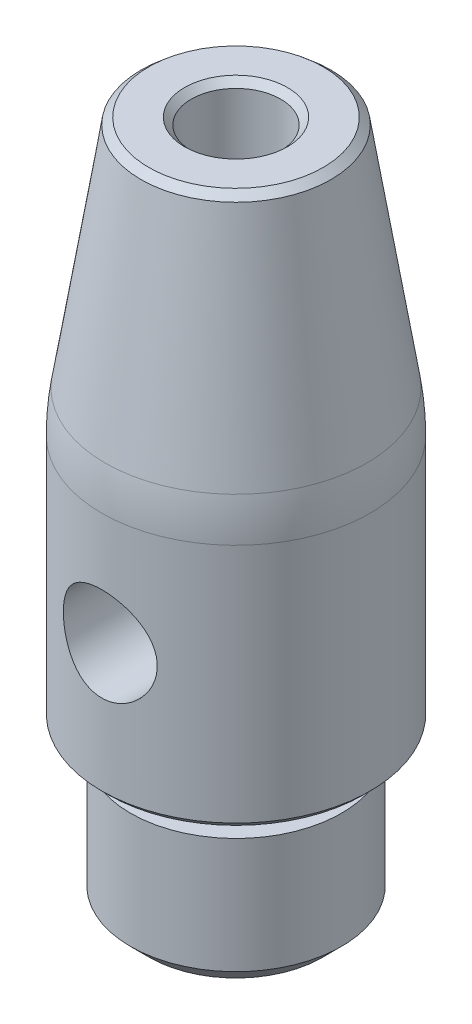
ISO-10303-21;
HEADER;
FILE_DESCRIPTION(('STEP AP214'),'2;1');
FILE_NAME('part.step','',(''),(''),'','','');
FILE_SCHEMA(('AUTOMOTIVE_DESIGN { 1 0 10303 214 1 1 1 1 }'));
ENDSEC;
DATA;
#1=APPLICATION_CONTEXT('core data for automotive mechanical design processes');
#2=APPLICATION_PROTOCOL_DEFINITION('international standard','automotive_design',2000,#1);
#3=PRODUCT_CONTEXT('',#1,'mechanical');
#4=PRODUCT('Part','Part','',(#3));
#5=PRODUCT_RELATED_PRODUCT_CATEGORY('part','',(#4));
#6=PRODUCT_DEFINITION_FORMATION('','',#4);
#7=PRODUCT_DEFINITION_CONTEXT('part definition',#1,'design');
#8=PRODUCT_DEFINITION('design','',#6,#7);
#9=PRODUCT_DEFINITION_SHAPE('','',#8);
#10=(LENGTH_UNIT() NAMED_UNIT(*) SI_UNIT(.MILLI.,.METRE.));
#11=(NAMED_UNIT(*) PLANE_ANGLE_UNIT() SI_UNIT($,.RADIAN.));
#12=(NAMED_UNIT(*) SI_UNIT($,.STERADIAN.) SOLID_ANGLE_UNIT());
#13=UNCERTAINTY_MEASURE_WITH_UNIT(LENGTH_MEASURE(1.E-05),#10,'distance_accuracy_value','');
#14=(GEOMETRIC_REPRESENTATION_CONTEXT(3) GLOBAL_UNCERTAINTY_ASSIGNED_CONTEXT((#13)) GLOBAL_UNIT_ASSIGNED_CONTEXT((#10,
#11,#12)) REPRESENTATION_CONTEXT('',''));
#15=CARTESIAN_POINT('',(0.,0.,0.));
#16=DIRECTION('',(0.,0.,1.));
#17=DIRECTION('',(1.,0.,0.));
#18=AXIS2_PLACEMENT_3D('',#15,#16,#17);
#19=CARTESIAN_POINT('',(0.,0.,0.));
#20=DIRECTION('',(0.,-1.,0.));
#21=DIRECTION('',(0.,0.,-1.));
#22=AXIS2_PLACEMENT_3D('',#19,#20,#21);
#23=PLANE('',#22);
#24=CARTESIAN_POINT('',(0.,0.,0.));
#25=DIRECTION('',(0.,1.,0.));
#26=DIRECTION('',(0.,0.,1.));
#27=AXIS2_PLACEMENT_3D('',#24,#25,#26);
#28=CIRCLE('',#27,3.23299999990923);
#29=CARTESIAN_POINT('',(0.,0.,3.23299999990923));
#30=VERTEX_POINT('',#29);
#31=EDGE_CURVE('E20',#30,#30,#28,.T.);
#32=ORIENTED_EDGE('',*,*,#31,.F.);
#33=EDGE_LOOP('',(#32));
#34=FACE_BOUND('',#33,.T.);
#35=ADVANCED_FACE('F16',(#34),#23,.T.);
#36=CARTESIAN_POINT('',(0.,15.4999999999745,0.));
#37=DIRECTION('',(0.,1.,0.));
#38=DIRECTION('',(0.,0.,1.));
#39=AXIS2_PLACEMENT_3D('',#36,#37,#38);
#40=CONICAL_SURFACE('',#39,1.66600000000017,1.0297442586289);
#41=CARTESIAN_POINT('',(0.,15.5,0.));
#42=DIRECTION('',(0.,-1.,0.));
#43=DIRECTION('',(0.,0.,-1.));
#44=AXIS2_PLACEMENT_3D('',#41,#42,#43);
#45=CIRCLE('',#44,1.666);
#46=CARTESIAN_POINT('',(0.,15.5,-1.666));
#47=VERTEX_POINT('',#46);
#48=EDGE_CURVE('E94',#47,#47,#45,.F.);
#49=ORIENTED_EDGE('',*,*,#48,.T.);
#50=EDGE_LOOP('',(#49));
#51=FACE_BOUND('',#50,.T.);
#52=CARTESIAN_POINT('',(0.,14.4989662086346,1.13686837721616E-10));
#53=VERTEX_POINT('',#52);
#54=VERTEX_LOOP('',#53);
#55=FACE_BOUND('',#54,.T.);
#56=ADVANCED_FACE('F28',(#51,#55),#40,.F.);
#57=CARTESIAN_POINT('',(0.,0.699999999994816,0.));
#58=DIRECTION('',(0.,1.,0.));
#59=DIRECTION('',(0.,0.,1.));
#60=AXIS2_PLACEMENT_3D('',#57,#58,#59);
#61=CONICAL_SURFACE('',#60,3.9329999998472,0.785398163356846);
#62=CARTESIAN_POINT('',(0.,0.7,0.));
#63=DIRECTION('',(0.,-1.,0.));
#64=DIRECTION('',(0.,0.,-1.));
#65=AXIS2_PLACEMENT_3D('',#62,#63,#64);
#66=CIRCLE('',#65,3.933);
#67=CARTESIAN_POINT('',(0.,0.7,-3.933));
#68=VERTEX_POINT('',#67);
#69=EDGE_CURVE('E90',#68,#68,#66,.F.);
#70=ORIENTED_EDGE('',*,*,#69,.F.);
#71=EDGE_LOOP('',(#70));
#72=FACE_BOUND('',#71,.T.);
#73=ORIENTED_EDGE('',*,*,#31,.T.);
#74=EDGE_LOOP('',(#73));
#75=FACE_BOUND('',#74,.T.);
#76=ADVANCED_FACE('F30',(#72,#75),#61,.T.);
#77=CARTESIAN_POINT('',(0.,20.5,0.));
#78=DIRECTION('',(0.,-1.,0.));
#79=DIRECTION('',(0.,0.,-1.));
#80=AXIS2_PLACEMENT_3D('',#77,#78,#79);
#81=CYLINDRICAL_SURFACE('',#80,1.666);
#82=ORIENTED_EDGE('',*,*,#48,.F.);
#83=EDGE_LOOP('',(#82));
#84=FACE_BOUND('',#83,.T.);
#85=CARTESIAN_POINT('',(0.,25.2500000000282,0.));
#86=DIRECTION('',(0.,1.,0.));
#87=DIRECTION('',(0.,0.,-1.));
#88=AXIS2_PLACEMENT_3D('',#85,#86,#87);
#89=CIRCLE('',#88,1.66600000000017);
#90=CARTESIAN_POINT('',(0.,25.2500000000282,-1.66600000000017));
#91=VERTEX_POINT('',#90);
#92=EDGE_CURVE('E86',#91,#91,#89,.T.);
#93=ORIENTED_EDGE('',*,*,#92,.T.);
#94=EDGE_LOOP('',(#93));
#95=FACE_BOUND('',#94,.T.);
#96=ADVANCED_FACE('F38',(#84,#95),#81,.F.);
#97=CARTESIAN_POINT('',(0.,2.5,0.));
#98=DIRECTION('',(0.,-1.,0.));
#99=DIRECTION('',(0.,0.,-1.));
#100=AXIS2_PLACEMENT_3D('',#97,#98,#99);
#101=CYLINDRICAL_SURFACE('',#100,3.933);
#102=CARTESIAN_POINT('',(0.,5.,0.));
#103=DIRECTION('',(0.,-1.,0.));
#104=DIRECTION('',(0.,0.,-1.));
#105=AXIS2_PLACEMENT_3D('',#102,#103,#104);
#106=CIRCLE('',#105,3.933);
#107=CARTESIAN_POINT('',(0.,5.,-3.933));
#108=VERTEX_POINT('',#107);
#109=EDGE_CURVE('E84',#108,#108,#106,.F.);
#110=ORIENTED_EDGE('',*,*,#109,.F.);
#111=EDGE_LOOP('',(#110));
#112=FACE_BOUND('',#111,.T.);
#113=ORIENTED_EDGE('',*,*,#69,.T.);
#114=EDGE_LOOP('',(#113));
#115=FACE_BOUND('',#114,.T.);
#116=ADVANCED_FACE('F152',(#112,#115),#101,.T.);
#117=CARTESIAN_POINT('',(0.,25.5000000000791,0.));
#118=DIRECTION('',(0.,1.,0.));
#119=DIRECTION('',(0.,0.,1.));
#120=AXIS2_PLACEMENT_3D('',#117,#118,#119);
#121=CONICAL_SURFACE('',#120,1.91599999999426,0.785398163283761);
#122=ORIENTED_EDGE('',*,*,#92,.F.);
#123=EDGE_LOOP('',(#122));
#124=FACE_BOUND('',#123,.T.);
#125=CARTESIAN_POINT('',(0.,25.5000000000791,0.));
#126=DIRECTION('',(0.,1.,0.));
#127=DIRECTION('',(0.,0.,1.));
#128=AXIS2_PLACEMENT_3D('',#125,#126,#127);
#129=CIRCLE('',#128,1.91599999999426);
#130=CARTESIAN_POINT('',(0.,25.5000000000791,1.91599999999426));
#131=VERTEX_POINT('',#130);
#132=EDGE_CURVE('E82',#131,#131,#129,.F.);
#133=ORIENTED_EDGE('',*,*,#132,.F.);
#134=EDGE_LOOP('',(#133));
#135=FACE_BOUND('',#134,.T.);
#136=ADVANCED_FACE('F148',(#124,#135),#121,.F.);
#137=CARTESIAN_POINT('',(4.,5.,0.));
#138=DIRECTION('',(0.,1.,0.));
#139=DIRECTION('',(0.,0.,1.));
#140=AXIS2_PLACEMENT_3D('',#137,#138,#139);
#141=PLANE('',#140);
#142=CARTESIAN_POINT('',(0.,5.,0.));
#143=DIRECTION('',(0.,-1.,0.));
#144=DIRECTION('',(0.,0.,-1.));
#145=AXIS2_PLACEMENT_3D('',#142,#143,#144);
#146=CIRCLE('',#145,3.25);
#147=CARTESIAN_POINT('',(0.,5.,-3.25));
#148=VERTEX_POINT('',#147);
#149=EDGE_CURVE('E79',#148,#148,#146,.F.);
#150=ORIENTED_EDGE('',*,*,#149,.F.);
#151=EDGE_LOOP('',(#150));
#152=FACE_BOUND('',#151,.T.);
#153=ORIENTED_EDGE('',*,*,#109,.T.);
#154=EDGE_LOOP('',(#153));
#155=FACE_BOUND('',#154,.T.);
#156=ADVANCED_FACE('F144',(#152,#155),#141,.T.);
#157=CARTESIAN_POINT('',(3.5,25.5,0.));
#158=DIRECTION('',(0.,1.,0.));
#159=DIRECTION('',(0.,0.,1.));
#160=AXIS2_PLACEMENT_3D('',#157,#158,#159);
#161=PLANE('',#160);
#162=ORIENTED_EDGE('',*,*,#132,.T.);
#163=EDGE_LOOP('',(#162));
#164=FACE_BOUND('',#163,.T.);
#165=CARTESIAN_POINT('',(0.,25.4999999999654,0.));
#166=DIRECTION('',(0.,-1.,0.));
#167=DIRECTION('',(0.,0.,-1.));
#168=AXIS2_PLACEMENT_3D('',#165,#166,#167);
#169=CIRCLE('',#168,3.25000000003683);
#170=CARTESIAN_POINT('',(0.,25.4999999999654,-3.25000000003683));
#171=VERTEX_POINT('',#170);
#172=EDGE_CURVE('E76',#171,#171,#169,.T.);
#173=ORIENTED_EDGE('',*,*,#172,.F.);
#174=EDGE_LOOP('',(#173));
#175=FACE_BOUND('',#174,.T.);
#176=ADVANCED_FACE('F140',(#164,#175),#161,.T.);
#177=CARTESIAN_POINT('',(0.,5.5,0.));
#178=DIRECTION('',(0.,-1.,0.));
#179=DIRECTION('',(0.,0.,-1.));
#180=AXIS2_PLACEMENT_3D('',#177,#178,#179);
#181=CYLINDRICAL_SURFACE('',#180,3.25);
#182=CARTESIAN_POINT('',(0.,6.,0.));
#183=DIRECTION('',(0.,-1.,0.));
#184=DIRECTION('',(0.,0.,-1.));
#185=AXIS2_PLACEMENT_3D('',#182,#183,#184);
#186=CIRCLE('',#185,3.25);
#187=CARTESIAN_POINT('',(0.,6.,-3.25));
#188=VERTEX_POINT('',#187);
#189=EDGE_CURVE('E73',#188,#188,#186,.F.);
#190=ORIENTED_EDGE('',*,*,#189,.F.);
#191=EDGE_LOOP('',(#190));
#192=FACE_BOUND('',#191,.T.);
#193=ORIENTED_EDGE('',*,*,#149,.T.);
#194=EDGE_LOOP('',(#193));
#195=FACE_BOUND('',#194,.T.);
#196=ADVANCED_FACE('F136',(#192,#195),#181,.T.);
#197=CARTESIAN_POINT('',(0.,25.2530592586595,0.));
#198=DIRECTION('',(0.,-1.,0.));
#199=DIRECTION('',(0.,0.,-1.));
#200=AXIS2_PLACEMENT_3D('',#197,#198,#199);
#201=CONICAL_SURFACE('',#200,3.53899064339203,0.8636991019188);
#202=ORIENTED_EDGE('',*,*,#172,.T.);
#203=EDGE_LOOP('',(#202));
#204=FACE_BOUND('',#203,.T.);
#205=CARTESIAN_POINT('',(0.,25.2530592586595,0.));
#206=DIRECTION('',(0.,-1.,0.));
#207=DIRECTION('',(1.,0.,0.));
#208=AXIS2_PLACEMENT_3D('',#205,#206,#207);
#209=CIRCLE('',#208,3.5389906433636);
#210=CARTESIAN_POINT('',(3.5389906433636,25.2530592586595,0.));
#211=VERTEX_POINT('',#210);
#212=EDGE_CURVE('E72',#211,#211,#209,.T.);
#213=ORIENTED_EDGE('',*,*,#212,.F.);
#214=EDGE_LOOP('',(#213));
#215=FACE_BOUND('',#214,.T.);
#216=ADVANCED_FACE('F130',(#204,#215),#201,.T.);
#217=CARTESIAN_POINT('',(3.25,6.,0.));
#218=DIRECTION('',(0.,-1.,0.));
#219=DIRECTION('',(0.,0.,-1.));
#220=AXIS2_PLACEMENT_3D('',#217,#218,#219);
#221=PLANE('',#220);
#222=ORIENTED_EDGE('',*,*,#189,.T.);
#223=EDGE_LOOP('',(#222));
#224=FACE_BOUND('',#223,.T.);
#225=CARTESIAN_POINT('',(0.,5.99999999991496,0.));
#226=DIRECTION('',(0.,1.,0.));
#227=DIRECTION('',(0.,0.,1.));
#228=AXIS2_PLACEMENT_3D('',#225,#226,#227);
#229=CIRCLE('',#228,4.75000000000136);
#230=CARTESIAN_POINT('',(0.,5.99999999991496,4.75000000000136));
#231=VERTEX_POINT('',#230);
#232=EDGE_CURVE('E68',#231,#231,#229,.T.);
#233=ORIENTED_EDGE('',*,*,#232,.F.);
#234=EDGE_LOOP('',(#233));
#235=FACE_BOUND('',#234,.T.);
#236=ADVANCED_FACE('F124',(#224,#235),#221,.T.);
#237=CARTESIAN_POINT('',(0.,16.7750121959784,0.));
#238=DIRECTION('',(0.,-1.,0.));
#239=DIRECTION('',(0.,0.,-1.));
#240=AXIS2_PLACEMENT_3D('',#237,#238,#239);
#241=CONICAL_SURFACE('',#240,4.8776296532651,0.156601876982704);
#242=ORIENTED_EDGE('',*,*,#212,.T.);
#243=EDGE_LOOP('',(#242));
#244=FACE_BOUND('',#243,.T.);
#245=CARTESIAN_POINT('',(0.,16.7750121958256,0.));
#246=DIRECTION('',(0.,1.,0.));
#247=DIRECTION('',(0.,0.,1.));
#248=AXIS2_PLACEMENT_3D('',#245,#246,#247);
#249=CIRCLE('',#248,4.87762965329069);
#250=CARTESIAN_POINT('',(0.,16.7750121958256,4.87762965329069));
#251=VERTEX_POINT('',#250);
#252=EDGE_CURVE('E71',#251,#251,#249,.T.);
#253=ORIENTED_EDGE('',*,*,#252,.T.);
#254=EDGE_LOOP('',(#253));
#255=FACE_BOUND('',#254,.T.);
#256=ADVANCED_FACE('F119',(#244,#255),#241,.T.);
#257=CARTESIAN_POINT('',(0.,6.24999999990905,0.));
#258=DIRECTION('',(0.,1.,0.));
#259=DIRECTION('',(0.,0.,1.));
#260=AXIS2_PLACEMENT_3D('',#257,#258,#259);
#261=CONICAL_SURFACE('',#260,4.99999999999545,0.785398163397448);
#262=CARTESIAN_POINT('',(0.,6.25,0.));
#263=DIRECTION('',(0.,-1.,0.));
#264=DIRECTION('',(0.,0.,-1.));
#265=AXIS2_PLACEMENT_3D('',#262,#263,#264);
#266=CIRCLE('',#265,5.);
#267=CARTESIAN_POINT('',(0.,6.25,-5.));
#268=VERTEX_POINT('',#267);
#269=EDGE_CURVE('E106',#268,#268,#266,.F.);
#270=ORIENTED_EDGE('',*,*,#269,.F.);
#271=EDGE_LOOP('',(#270));
#272=FACE_BOUND('',#271,.T.);
#273=ORIENTED_EDGE('',*,*,#232,.T.);
#274=EDGE_LOOP('',(#273));
#275=FACE_BOUND('',#274,.T.);
#276=ADVANCED_FACE('F114',(#272,#275),#261,.T.);
#277=CARTESIAN_POINT('',(0.,15.2153864610955,0.));
#278=DIRECTION('',(0.,-1.,0.));
#279=DIRECTION('',(0.,0.,-1.));
#280=AXIS2_PLACEMENT_3D('',#277,#278,#279);
#281=DEGENERATE_TOROIDAL_SURFACE('',#280,4.99999999999954,9.99999999999954,.F.);
#282=ORIENTED_EDGE('',*,*,#252,.F.);
#283=EDGE_LOOP('',(#282));
#284=FACE_BOUND('',#283,.T.);
#285=CARTESIAN_POINT('',(0.,15.2153864610955,0.));
#286=DIRECTION('',(0.,-1.,0.));
#287=DIRECTION('',(0.,0.,-1.));
#288=AXIS2_PLACEMENT_3D('',#285,#286,#287);
#289=CIRCLE('',#288,5.);
#290=CARTESIAN_POINT('',(0.,15.2153864610955,-5.));
#291=VERTEX_POINT('',#290);
#292=EDGE_CURVE('E67',#291,#291,#289,.T.);
#293=ORIENTED_EDGE('',*,*,#292,.F.);
#294=EDGE_LOOP('',(#293));
#295=FACE_BOUND('',#294,.T.);
#296=ADVANCED_FACE('F18',(#284,#295),#281,.F.);
#297=CARTESIAN_POINT('',(0.,11.,0.));
#298=DIRECTION('',(0.,0.,1.));
#299=DIRECTION('',(1.,0.,0.));
#300=AXIS2_PLACEMENT_3D('',#297,#298,#299);
#301=CYLINDRICAL_SURFACE('',#300,1.75);
#302=CARTESIAN_POINT('',(-1.75,11.,4.6837484987988));
#303=CARTESIAN_POINT('',(-1.75000152826706,11.0950076142216,4.68374720485959));
#304=CARTESIAN_POINT('',(-1.74223702845892,11.1900045831409,4.68667080692753));
#305=CARTESIAN_POINT('',(-1.71150284343091,11.377164613439,4.6979805396323));
#306=CARTESIAN_POINT('',(-1.68853189484273,11.4693274386883,4.70636712413873));
#307=CARTESIAN_POINT('',(-1.6283062855171,11.6480733418047,4.72753898808221));
#308=CARTESIAN_POINT('',(-1.59108197521608,11.7346678221525,4.74031491516133));
#309=CARTESIAN_POINT('',(-1.50351160924169,11.9004133837024,4.76881178214549));
#310=CARTESIAN_POINT('',(-1.45316221737773,11.9795625654549,4.78453347053087));
#311=CARTESIAN_POINT('',(-1.33844146982531,12.1315893083913,4.81791171246093));
#312=CARTESIAN_POINT('',(-1.27359743759366,12.2040989219186,4.83561998092638));
#313=CARTESIAN_POINT('',(-1.13273458125577,12.3374687470166,4.87054126917138));
#314=CARTESIAN_POINT('',(-1.05671375209411,12.3983268638541,4.88775419942611));
#315=CARTESIAN_POINT('',(-0.892925093026129,12.50837506446,4.92035027857299));
#316=CARTESIAN_POINT('',(-0.804879787036825,12.5571740450381,4.93566559950246));
#317=CARTESIAN_POINT('',(-0.621200717106752,12.6391198088743,4.96212680122129));
#318=CARTESIAN_POINT('',(-0.52556923264072,12.6722712732039,4.9732739287493));
#319=CARTESIAN_POINT('',(-0.333294441128115,12.7207167887382,4.98977617197834));
#320=CARTESIAN_POINT('',(-0.236828119050407,12.736642372526,4.99533555255298));
#321=CARTESIAN_POINT('',(-0.0424428010719142,12.7521980876596,5.00076407475328));
#322=CARTESIAN_POINT('',(0.055475774937992,12.7518328407775,5.00063483026419));
#323=CARTESIAN_POINT('',(0.245494270684965,12.7352051918272,4.99483582345016));
#324=CARTESIAN_POINT('',(0.337662857195478,12.7196299848309,4.98940556776971));
#325=CARTESIAN_POINT('',(0.517984230962889,12.6741684860387,4.97392058678691));
#326=CARTESIAN_POINT('',(0.606136739449903,12.6442812024447,4.96386554099777));
#327=CARTESIAN_POINT('',(0.777357415908936,12.5706753483943,4.9399693484705));
#328=CARTESIAN_POINT('',(0.860338791740312,12.5267718739985,4.92607794289925));
#329=CARTESIAN_POINT('',(1.01795058700634,12.426536273338,4.89593962051638));
#330=CARTESIAN_POINT('',(1.09257851602779,12.3702004554145,4.87969200454427));
#331=CARTESIAN_POINT('',(1.23543995953403,12.2432939265509,4.84555061636556));
#332=CARTESIAN_POINT('',(1.30314530587507,12.1721389824787,4.82761516171595));
#333=CARTESIAN_POINT('',(1.42584439192423,12.0193480081168,4.79281181598576));
#334=CARTESIAN_POINT('',(1.48083573193509,11.9377100037237,4.77594412687552));
#335=CARTESIAN_POINT('',(1.57738076604104,11.7644399654441,4.74494411656163));
#336=CARTESIAN_POINT('',(1.61868813477292,11.6726606884956,4.7308636022452));
#337=CARTESIAN_POINT('',(1.68507378723152,11.4828293257456,4.70762977262316));
#338=CARTESIAN_POINT('',(1.71015971870381,11.3847802199077,4.69847413578168));
#339=CARTESIAN_POINT('',(1.74226665309119,11.190351625215,4.68666052959585));
#340=CARTESIAN_POINT('',(1.75011468633883,11.0941268011973,4.68370541076474));
#341=CARTESIAN_POINT('',(1.74988283838022,10.9017104197443,4.68379251162851));
#342=CARTESIAN_POINT('',(1.74180624440865,10.805518859542,4.68683349358072));
#343=CARTESIAN_POINT('',(1.71070041976783,10.6198409408194,4.69827167763639));
#344=CARTESIAN_POINT('',(1.68827004723643,10.530239566537,4.70645413390635));
#345=CARTESIAN_POINT('',(1.62982534360075,10.3560984655212,4.72700986323119));
#346=CARTESIAN_POINT('',(1.59380845350784,10.2715596957955,4.73938392572043));
#347=CARTESIAN_POINT('',(1.50782257741686,10.1067452779148,4.76744975837994));
#348=CARTESIAN_POINT('',(1.45741978475385,10.0267132358148,4.78324025669695));
#349=CARTESIAN_POINT('',(1.34457250316525,9.87594577571804,4.81617843481946));
#350=CARTESIAN_POINT('',(1.28212412109629,9.80521337583498,4.83332655234922));
#351=CARTESIAN_POINT('',(1.14296623724276,9.67110635728791,4.8681655951297));
#352=CARTESIAN_POINT('',(1.06566944246506,9.60833390367782,4.8858359511495));
#353=CARTESIAN_POINT('',(0.901202968061247,9.49659909867077,4.91882686414116));
#354=CARTESIAN_POINT('',(0.814033517875275,9.44763642642726,4.93414747570151));
#355=CARTESIAN_POINT('',(0.632608081715859,9.36532286955579,4.96066068118222));
#356=CARTESIAN_POINT('',(0.5383950226831,9.33188514483698,4.97187616093787));
#357=CARTESIAN_POINT('',(0.345207375034694,9.28148720951612,4.98900968413634));
#358=CARTESIAN_POINT('',(0.246234719659122,9.26452036716228,4.99492985957784));
#359=CARTESIAN_POINT('',(0.0518184418761803,9.24818979369822,5.00062864866872));
#360=CARTESIAN_POINT('',(-0.0435448173803363,9.24796543576391,5.00070752541974));
#361=CARTESIAN_POINT('',(-0.232887536964348,9.26296804812376,4.99547100210103));
#362=CARTESIAN_POINT('',(-0.326867128707221,9.27819354132096,4.99015611770669));
#363=CARTESIAN_POINT('',(-0.508981819704914,9.32307734593306,4.97485061583987));
#364=CARTESIAN_POINT('',(-0.597194029730125,9.35245598991649,4.9649507389044));
#365=CARTESIAN_POINT('',(-0.767462013569867,9.42454635492223,4.9414973575352));
#366=CARTESIAN_POINT('',(-0.849516639306424,9.46726055472777,4.92794317391108));
#367=CARTESIAN_POINT('',(-1.00865029316432,9.56672719148091,4.89790160847887));
#368=CARTESIAN_POINT('',(-1.08540856336538,9.62396394049503,4.88132013454011));
#369=CARTESIAN_POINT('',(-1.22850678053986,9.75005133281321,4.84728694910474));
#370=CARTESIAN_POINT('',(-1.29484322176796,9.81890586807981,4.82983494736559));
#371=CARTESIAN_POINT('',(-1.41822148526311,9.96991854510732,4.79509560795335));
#372=CARTESIAN_POINT('',(-1.4747204801434,10.0525313330435,4.77784991480602));
#373=CARTESIAN_POINT('',(-1.57301525999125,10.2266238571582,4.74639844695309));
#374=CARTESIAN_POINT('',(-1.61481294785142,10.3181024438181,4.73219227891386));
#375=CARTESIAN_POINT('',(-1.68188417056926,10.506402148469,4.70877102027301));
#376=CARTESIAN_POINT('',(-1.70733571976716,10.6031528132746,4.69950235516207));
#377=CARTESIAN_POINT('',(-1.74138904665236,10.7999405826631,4.68699312905296));
#378=CARTESIAN_POINT('',(-1.74999839104377,10.8999761908689,4.68374986105518));
#379=CARTESIAN_POINT('',(-1.75,11.,4.6837484987988));
#380=B_SPLINE_CURVE_WITH_KNOTS('',3,(#302,#303,#304,#305,#306,#307,#308,#309,#310,#311,#312,
#313,#314,#315,#316,#317,#318,#319,#320,#321,#322,#323,#324,#325,#326,#327,#328,#329,#330,#331,
#332,#333,#334,#335,#336,#337,#338,#339,#340,#341,#342,#343,#344,#345,#346,#347,#348,#349,#350,
#351,#352,#353,#354,#355,#356,#357,#358,#359,#360,#361,#362,#363,#364,#365,#366,#367,#368,#369,
#370,#371,#372,#373,#374,#375,#376,#377,#378,#379),.UNSPECIFIED.,.T.,.F.,(4,2,2,2,2,2,2,2,2,2,2,
2,2,2,2,2,2,2,2,2,2,2,2,2,2,2,2,2,2,2,2,2,2,2,2,2,2,2,4),(0.,0.284651635594199,
0.569326923324704,0.853399377903852,1.13754410978839,1.43283816033969,1.728185249792,
2.03212748646943,2.335978738831,2.62826736544508,2.92047306916392,3.20005995651959,
3.4796662214922,3.76312511804983,4.04666829838923,4.34483254952084,4.64305303162079,
4.9463820695136,5.24956799567807,5.53785739185869,5.82608728424851,6.1030129437274,
6.37999078756695,6.66641167236913,6.95292528419449,7.25488366573244,7.55683503120821,
7.85707643107363,8.15719689307681,8.44187881225603,8.72653351672762,9.00578077768927,
9.28507997544029,9.57531854538556,9.86565453910385,10.1688694665245,10.4720451322684,
10.7718604827926,11.0715411041912),.UNSPECIFIED.);
#381=CARTESIAN_POINT('',(-1.75,11.,4.6837484987988));
#382=VERTEX_POINT('',#381);
#383=EDGE_CURVE('E24',#382,#382,#380,.T.);
#384=ORIENTED_EDGE('',*,*,#383,.F.);
#385=EDGE_LOOP('',(#384));
#386=FACE_BOUND('',#385,.T.);
#387=CARTESIAN_POINT('',(-1.75,11.,-4.6837484987988));
#388=CARTESIAN_POINT('',(-1.75000152826706,10.9049923857784,-4.68374720485959));
#389=CARTESIAN_POINT('',(-1.74223702845892,10.8099954168591,-4.68667080692753));
#390=CARTESIAN_POINT('',(-1.71150284343091,10.622835386561,-4.6979805396323));
#391=CARTESIAN_POINT('',(-1.68853189484273,10.5306725613117,-4.70636712413873));
#392=CARTESIAN_POINT('',(-1.6283062855171,10.3519266581953,-4.72753898808221));
#393=CARTESIAN_POINT('',(-1.59108197521608,10.2653321778475,-4.74031491516133));
#394=CARTESIAN_POINT('',(-1.50351160924169,10.0995866162976,-4.76881178214549));
#395=CARTESIAN_POINT('',(-1.45316221737773,10.0204374345451,-4.78453347053087));
#396=CARTESIAN_POINT('',(-1.33844146982531,9.86841069160868,-4.81791171246093));
#397=CARTESIAN_POINT('',(-1.27359743759365,9.79590107808135,-4.83561998092638));
#398=CARTESIAN_POINT('',(-1.13273458125577,9.66253125298336,-4.87054126917138));
#399=CARTESIAN_POINT('',(-1.0567137520941,9.60167313614586,-4.88775419942611));
#400=CARTESIAN_POINT('',(-0.892925093026125,9.49162493554003,-4.92035027857299));
#401=CARTESIAN_POINT('',(-0.804879787036821,9.44282595496189,-4.93566559950246));
#402=CARTESIAN_POINT('',(-0.621200717106748,9.36088019112572,-4.96212680122129));
#403=CARTESIAN_POINT('',(-0.525569232640715,9.32772872679606,-4.9732739287493));
#404=CARTESIAN_POINT('',(-0.333294441128111,9.27928321126179,-4.98977617197834));
#405=CARTESIAN_POINT('',(-0.236828119050402,9.26335762747396,-4.99533555255298));
#406=CARTESIAN_POINT('',(-0.04244280107191,9.24780191234038,-5.00076407475328));
#407=CARTESIAN_POINT('',(0.055475774937996,9.24816715922245,-5.00063483026419));
#408=CARTESIAN_POINT('',(0.245494270684969,9.26479480817277,-4.99483582345016));
#409=CARTESIAN_POINT('',(0.337662857195483,9.28037001516915,-4.98940556776971));
#410=CARTESIAN_POINT('',(0.517984230962894,9.32583151396128,-4.97392058678691));
#411=CARTESIAN_POINT('',(0.606136739449907,9.35571879755534,-4.96386554099777));
#412=CARTESIAN_POINT('',(0.77735741590894,9.42932465160568,-4.9399693484705));
#413=CARTESIAN_POINT('',(0.860338791740316,9.47322812600146,-4.92607794289925));
#414=CARTESIAN_POINT('',(1.01795058700635,9.57346372666198,-4.89593962051638));
#415=CARTESIAN_POINT('',(1.09257851602779,9.62979954458547,-4.87969200454427));
#416=CARTESIAN_POINT('',(1.23543995953404,9.75670607344908,-4.84555061636556));
#417=CARTESIAN_POINT('',(1.30314530587507,9.82786101752132,-4.82761516171595));
#418=CARTESIAN_POINT('',(1.42584439192424,9.98065199188325,-4.79281181598576));
#419=CARTESIAN_POINT('',(1.4808357319351,10.0622899962763,-4.77594412687552));
#420=CARTESIAN_POINT('',(1.57738076604105,10.2355600345559,-4.74494411656163));
#421=CARTESIAN_POINT('',(1.61868813477292,10.3273393115044,-4.7308636022452));
#422=CARTESIAN_POINT('',(1.68507378723152,10.5171706742544,-4.70762977262316));
#423=CARTESIAN_POINT('',(1.71015971870381,10.6152197800923,-4.69847413578168));
#424=CARTESIAN_POINT('',(1.74226665309119,10.809648374785,-4.68666052959585));
#425=CARTESIAN_POINT('',(1.75011468633883,10.9058731988027,-4.68370541076474));
#426=CARTESIAN_POINT('',(1.74988283838022,11.0982895802557,-4.68379251162851));
#427=CARTESIAN_POINT('',(1.74180624440865,11.194481140458,-4.68683349358072));
#428=CARTESIAN_POINT('',(1.71070041976783,11.3801590591806,-4.69827167763639));
#429=CARTESIAN_POINT('',(1.68827004723643,11.469760433463,-4.70645413390636));
#430=CARTESIAN_POINT('',(1.62982534360075,11.6439015344788,-4.72700986323119));
#431=CARTESIAN_POINT('',(1.59380845350784,11.7284403042045,-4.73938392572043));
#432=CARTESIAN_POINT('',(1.50782257741686,11.8932547220852,-4.76744975837994));
#433=CARTESIAN_POINT('',(1.45741978475385,11.9732867641852,-4.78324025669695));
#434=CARTESIAN_POINT('',(1.34457250316525,12.124054224282,-4.81617843481946));
#435=CARTESIAN_POINT('',(1.28212412109629,12.194786624165,-4.83332655234922));
#436=CARTESIAN_POINT('',(1.14296623724276,12.3288936427121,-4.8681655951297));
#437=CARTESIAN_POINT('',(1.06566944246506,12.3916660963222,-4.8858359511495));
#438=CARTESIAN_POINT('',(0.901202968061245,12.5034009013292,-4.91882686414116));
#439=CARTESIAN_POINT('',(0.814033517875272,12.5523635735727,-4.93414747570151));
#440=CARTESIAN_POINT('',(0.632608081715855,12.6346771304442,-4.96066068118222));
#441=CARTESIAN_POINT('',(0.538395022683095,12.668114855163,-4.97187616093787));
#442=CARTESIAN_POINT('',(0.34520737503469,12.7185127904839,-4.98900968413634));
#443=CARTESIAN_POINT('',(0.246234719659117,12.7354796328377,-4.99492985957784));
#444=CARTESIAN_POINT('',(0.0518184418761767,12.7518102063018,-5.00062864866872));
#445=CARTESIAN_POINT('',(-0.0435448173803395,12.7520345642361,-5.00070752541974));
#446=CARTESIAN_POINT('',(-0.232887536964351,12.7370319518762,-4.99547100210103));
#447=CARTESIAN_POINT('',(-0.326867128707224,12.721806458679,-4.99015611770669));
#448=CARTESIAN_POINT('',(-0.508981819704918,12.6769226540669,-4.97485061583987));
#449=CARTESIAN_POINT('',(-0.597194029730128,12.6475440100835,-4.96495073890441));
#450=CARTESIAN_POINT('',(-0.76746201356987,12.5754536450778,-4.9414973575352));
#451=CARTESIAN_POINT('',(-0.849516639306427,12.5327394452722,-4.92794317391108));
#452=CARTESIAN_POINT('',(-1.00865029316432,12.4332728085191,-4.89790160847887));
#453=CARTESIAN_POINT('',(-1.08540856336538,12.376036059505,-4.88132013454011));
#454=CARTESIAN_POINT('',(-1.22850678053987,12.2499486671868,-4.84728694910474));
#455=CARTESIAN_POINT('',(-1.29484322176797,12.1810941319202,-4.82983494736559));
#456=CARTESIAN_POINT('',(-1.41822148526311,12.0300814548927,-4.79509560795335));
#457=CARTESIAN_POINT('',(-1.4747204801434,11.9474686669565,-4.77784991480602));
#458=CARTESIAN_POINT('',(-1.57301525999125,11.7733761428418,-4.74639844695309));
#459=CARTESIAN_POINT('',(-1.61481294785142,11.6818975561819,-4.73219227891386));
#460=CARTESIAN_POINT('',(-1.68188417056926,11.493597851531,-4.70877102027301));
#461=CARTESIAN_POINT('',(-1.70733571976716,11.3968471867254,-4.69950235516207));
#462=CARTESIAN_POINT('',(-1.74138904665236,11.2000594173369,-4.68699312905296));
#463=CARTESIAN_POINT('',(-1.74999839104377,11.1000238091311,-4.68374986105518));
#464=CARTESIAN_POINT('',(-1.75,11.,-4.6837484987988));
#465=B_SPLINE_CURVE_WITH_KNOTS('',3,(#387,#388,#389,#390,#391,#392,#393,#394,#395,#396,#397,
#398,#399,#400,#401,#402,#403,#404,#405,#406,#407,#408,#409,#410,#411,#412,#413,#414,#415,#416,
#417,#418,#419,#420,#421,#422,#423,#424,#425,#426,#427,#428,#429,#430,#431,#432,#433,#434,#435,
#436,#437,#438,#439,#440,#441,#442,#443,#444,#445,#446,#447,#448,#449,#450,#451,#452,#453,#454,
#455,#456,#457,#458,#459,#460,#461,#462,#463,#464),.UNSPECIFIED.,.T.,.F.,(4,2,2,2,2,2,2,2,2,2,2,
2,2,2,2,2,2,2,2,2,2,2,2,2,2,2,2,2,2,2,2,2,2,2,2,2,2,2,4),(0.,0.284651635594199,
0.569326923324704,0.853399377903852,1.13754410978839,1.43283816033969,1.728185249792,
2.03212748646943,2.335978738831,2.62826736544508,2.92047306916392,3.20005995651959,
3.4796662214922,3.76312511804984,4.04666829838924,4.34483254952085,4.64305303162079,
4.94638206951359,5.24956799567807,5.53785739185869,5.82608728424852,6.1030129437274,
6.37999078756695,6.66641167236913,6.95292528419449,7.25488366573244,7.55683503120821,
7.85707643107363,8.15719689307681,8.44187881225603,8.72653351672762,9.00578077768927,
9.28507997544029,9.57531854538556,9.86565453910385,10.1688694665245,10.4720451322684,
10.7718604827926,11.0715411041912),.UNSPECIFIED.);
#466=CARTESIAN_POINT('',(-1.75,11.,-4.6837484987988));
#467=VERTEX_POINT('',#466);
#468=EDGE_CURVE('E11',#467,#467,#465,.T.);
#469=ORIENTED_EDGE('',*,*,#468,.F.);
#470=EDGE_LOOP('',(#469));
#471=FACE_BOUND('',#470,.T.);
#472=ADVANCED_FACE('F45',(#386,#471),#301,.F.);
#473=CARTESIAN_POINT('',(0.,11.,0.));
#474=DIRECTION('',(0.,-1.,0.));
#475=DIRECTION('',(0.,0.,-1.));
#476=AXIS2_PLACEMENT_3D('',#473,#474,#475);
#477=CYLINDRICAL_SURFACE('',#476,5.);
#478=ORIENTED_EDGE('',*,*,#292,.T.);
#479=EDGE_LOOP('',(#478));
#480=FACE_BOUND('',#479,.T.);
#481=ORIENTED_EDGE('',*,*,#468,.T.);
#482=EDGE_LOOP('',(#481));
#483=FACE_BOUND('',#482,.T.);
#484=ORIENTED_EDGE('',*,*,#383,.T.);
#485=EDGE_LOOP('',(#484));
#486=FACE_BOUND('',#485,.T.);
#487=ORIENTED_EDGE('',*,*,#269,.T.);
#488=EDGE_LOOP('',(#487));
#489=FACE_BOUND('',#488,.T.);
#490=ADVANCED_FACE('F43',(#480,#483,#486,#489),#477,.T.);
#491=CLOSED_SHELL('',(#35,#56,#76,#96,#116,#136,#156,#176,#196,#216,#236,#256,#276,#296,#472,#490));
#492=MANIFOLD_SOLID_BREP('B1',#491);
#493=ADVANCED_BREP_SHAPE_REPRESENTATION('',(#18,#492),#14);
#494=SHAPE_DEFINITION_REPRESENTATION(#9,#493);
ENDSEC;
END-ISO-10303-21;
